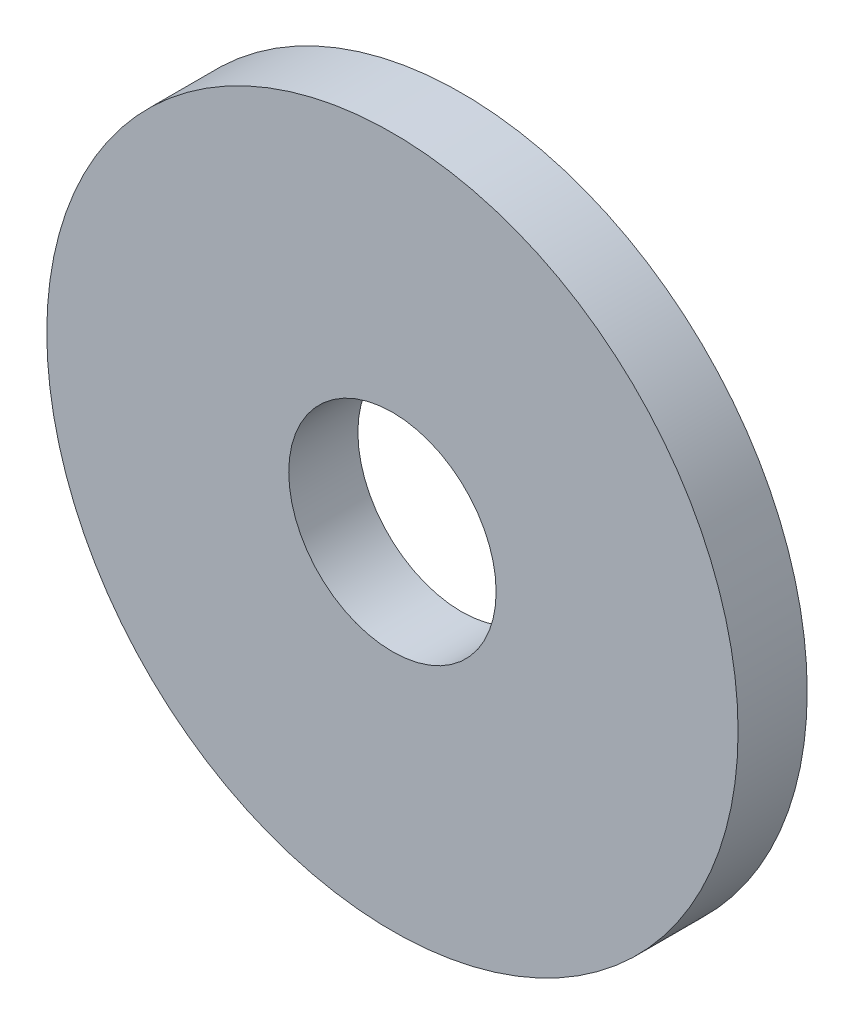
ISO-10303-21;
HEADER;
FILE_DESCRIPTION(('STEP AP214'),'2;1');
FILE_NAME('part.step','',(''),(''),'','','');
FILE_SCHEMA(('AUTOMOTIVE_DESIGN { 1 0 10303 214 1 1 1 1 }'));
ENDSEC;
DATA;
#1=APPLICATION_CONTEXT('core data for automotive mechanical design processes');
#2=APPLICATION_PROTOCOL_DEFINITION('international standard','automotive_design',2000,#1);
#3=PRODUCT_CONTEXT('',#1,'mechanical');
#4=PRODUCT('Part','Part','',(#3));
#5=PRODUCT_RELATED_PRODUCT_CATEGORY('part','',(#4));
#6=PRODUCT_DEFINITION_FORMATION('','',#4);
#7=PRODUCT_DEFINITION_CONTEXT('part definition',#1,'design');
#8=PRODUCT_DEFINITION('design','',#6,#7);
#9=PRODUCT_DEFINITION_SHAPE('','',#8);
#10=(LENGTH_UNIT() NAMED_UNIT(*) SI_UNIT(.MILLI.,.METRE.));
#11=(NAMED_UNIT(*) PLANE_ANGLE_UNIT() SI_UNIT($,.RADIAN.));
#12=(NAMED_UNIT(*) SI_UNIT($,.STERADIAN.) SOLID_ANGLE_UNIT());
#13=UNCERTAINTY_MEASURE_WITH_UNIT(LENGTH_MEASURE(1.E-05),#10,'distance_accuracy_value','');
#14=(GEOMETRIC_REPRESENTATION_CONTEXT(3) GLOBAL_UNCERTAINTY_ASSIGNED_CONTEXT((#13)) GLOBAL_UNIT_ASSIGNED_CONTEXT((#10,
#11,#12)) REPRESENTATION_CONTEXT('',''));
#15=CARTESIAN_POINT('',(0.,0.,0.));
#16=DIRECTION('',(0.,0.,1.));
#17=DIRECTION('',(1.,0.,0.));
#18=AXIS2_PLACEMENT_3D('',#15,#16,#17);
#19=CARTESIAN_POINT('',(0.,0.,1.));
#20=DIRECTION('',(0.,0.,1.));
#21=DIRECTION('',(1.,0.,0.));
#22=AXIS2_PLACEMENT_3D('',#19,#20,#21);
#23=PLANE('',#22);
#24=CARTESIAN_POINT('',(0.,0.,1.));
#25=DIRECTION('',(0.,0.,1.));
#26=DIRECTION('',(1.,0.,0.));
#27=AXIS2_PLACEMENT_3D('',#24,#25,#26);
#28=CIRCLE('',#27,5.);
#29=CARTESIAN_POINT('',(5.,0.,1.));
#30=VERTEX_POINT('',#29);
#31=EDGE_CURVE('E10',#30,#30,#28,.T.);
#32=ORIENTED_EDGE('',*,*,#31,.T.);
#33=EDGE_LOOP('',(#32));
#34=FACE_BOUND('',#33,.T.);
#35=CARTESIAN_POINT('',(0.,0.,1.));
#36=DIRECTION('',(0.,0.,1.));
#37=DIRECTION('',(1.,0.,0.));
#38=AXIS2_PLACEMENT_3D('',#35,#36,#37);
#39=CIRCLE('',#38,1.5);
#40=CARTESIAN_POINT('',(1.5,0.,1.));
#41=VERTEX_POINT('',#40);
#42=EDGE_CURVE('E42',#41,#41,#39,.T.);
#43=ORIENTED_EDGE('',*,*,#42,.F.);
#44=EDGE_LOOP('',(#43));
#45=FACE_BOUND('',#44,.T.);
#46=ADVANCED_FACE('F31',(#34,#45),#23,.T.);
#47=CARTESIAN_POINT('',(0.,0.,0.));
#48=DIRECTION('',(0.,0.,1.));
#49=DIRECTION('',(1.,0.,0.));
#50=AXIS2_PLACEMENT_3D('',#47,#48,#49);
#51=PLANE('',#50);
#52=CARTESIAN_POINT('',(0.,0.,0.));
#53=DIRECTION('',(0.,0.,1.));
#54=DIRECTION('',(1.,0.,0.));
#55=AXIS2_PLACEMENT_3D('',#52,#53,#54);
#56=CIRCLE('',#55,5.);
#57=CARTESIAN_POINT('',(5.,0.,0.));
#58=VERTEX_POINT('',#57);
#59=EDGE_CURVE('E35',#58,#58,#56,.T.);
#60=ORIENTED_EDGE('',*,*,#59,.F.);
#61=EDGE_LOOP('',(#60));
#62=FACE_BOUND('',#61,.T.);
#63=CARTESIAN_POINT('',(0.,0.,0.));
#64=DIRECTION('',(0.,0.,1.));
#65=DIRECTION('',(1.,0.,0.));
#66=AXIS2_PLACEMENT_3D('',#63,#64,#65);
#67=CIRCLE('',#66,1.5);
#68=CARTESIAN_POINT('',(1.5,0.,0.));
#69=VERTEX_POINT('',#68);
#70=EDGE_CURVE('E44',#69,#69,#67,.T.);
#71=ORIENTED_EDGE('',*,*,#70,.T.);
#72=EDGE_LOOP('',(#71));
#73=FACE_BOUND('',#72,.T.);
#74=ADVANCED_FACE('F54',(#62,#73),#51,.F.);
#75=CARTESIAN_POINT('',(0.,0.,1.));
#76=DIRECTION('',(0.,0.,-1.));
#77=DIRECTION('',(-1.,0.,0.));
#78=AXIS2_PLACEMENT_3D('',#75,#76,#77);
#79=CYLINDRICAL_SURFACE('',#78,5.);
#80=ORIENTED_EDGE('',*,*,#31,.F.);
#81=EDGE_LOOP('',(#80));
#82=FACE_BOUND('',#81,.T.);
#83=ORIENTED_EDGE('',*,*,#59,.T.);
#84=EDGE_LOOP('',(#83));
#85=FACE_BOUND('',#84,.T.);
#86=ADVANCED_FACE('F33',(#82,#85),#79,.T.);
#87=CARTESIAN_POINT('',(0.,0.,1.));
#88=DIRECTION('',(0.,0.,-1.));
#89=DIRECTION('',(-1.,0.,0.));
#90=AXIS2_PLACEMENT_3D('',#87,#88,#89);
#91=CYLINDRICAL_SURFACE('',#90,1.5);
#92=ORIENTED_EDGE('',*,*,#42,.T.);
#93=EDGE_LOOP('',(#92));
#94=FACE_BOUND('',#93,.T.);
#95=ORIENTED_EDGE('',*,*,#70,.F.);
#96=EDGE_LOOP('',(#95));
#97=FACE_BOUND('',#96,.T.);
#98=ADVANCED_FACE('F50',(#94,#97),#91,.F.);
#99=CLOSED_SHELL('',(#46,#74,#86,#98));
#100=MANIFOLD_SOLID_BREP('B2',#99);
#101=ADVANCED_BREP_SHAPE_REPRESENTATION('',(#18,#100),#14);
#102=SHAPE_DEFINITION_REPRESENTATION(#9,#101);
ENDSEC;
END-ISO-10303-21;
